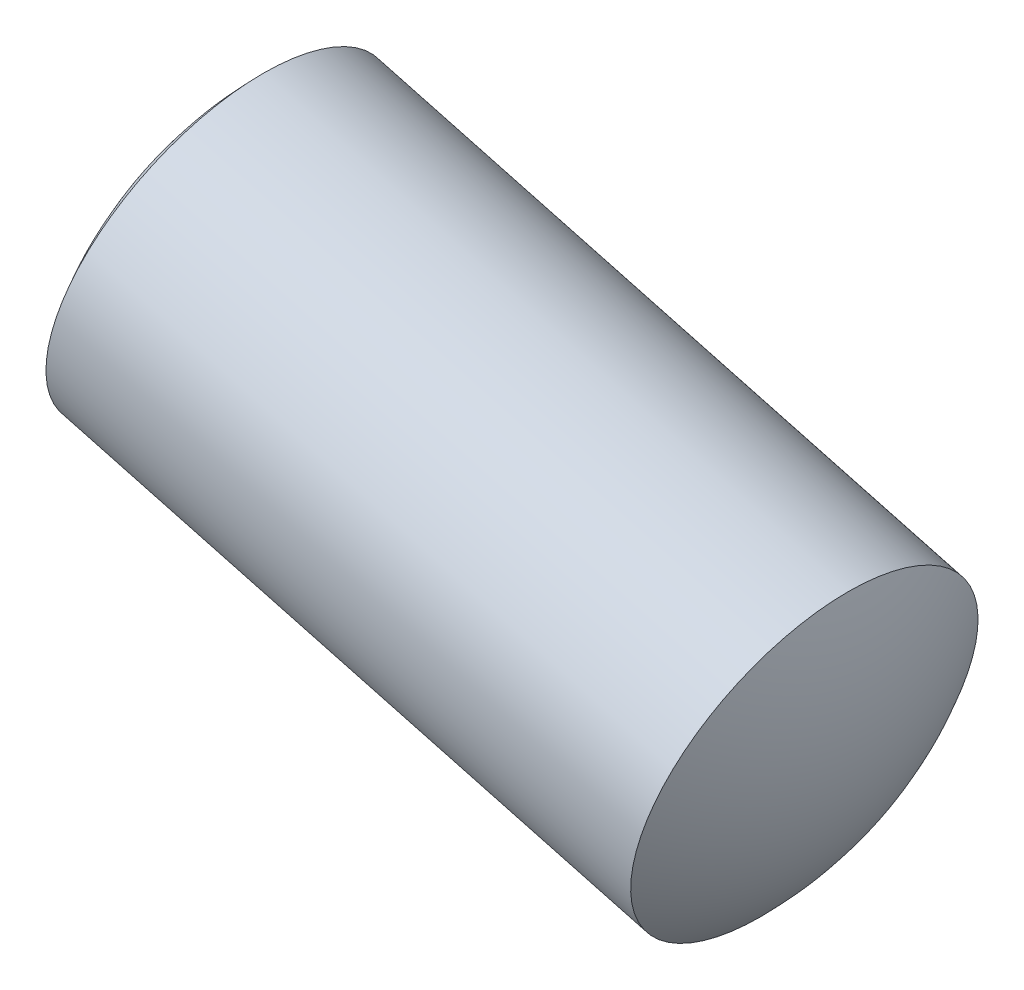
ISO-10303-21;
HEADER;
FILE_DESCRIPTION(('STEP AP214'),'2;1');
FILE_NAME('part.step','',(''),(''),'','','');
FILE_SCHEMA(('AUTOMOTIVE_DESIGN { 1 0 10303 214 1 1 1 1 }'));
ENDSEC;
DATA;
#1=APPLICATION_CONTEXT('core data for automotive mechanical design processes');
#2=APPLICATION_PROTOCOL_DEFINITION('international standard','automotive_design',2000,#1);
#3=PRODUCT_CONTEXT('',#1,'mechanical');
#4=PRODUCT('Part','Part','',(#3));
#5=PRODUCT_RELATED_PRODUCT_CATEGORY('part','',(#4));
#6=PRODUCT_DEFINITION_FORMATION('','',#4);
#7=PRODUCT_DEFINITION_CONTEXT('part definition',#1,'design');
#8=PRODUCT_DEFINITION('design','',#6,#7);
#9=PRODUCT_DEFINITION_SHAPE('','',#8);
#10=(LENGTH_UNIT() NAMED_UNIT(*) SI_UNIT(.MILLI.,.METRE.));
#11=(NAMED_UNIT(*) PLANE_ANGLE_UNIT() SI_UNIT($,.RADIAN.));
#12=(NAMED_UNIT(*) SI_UNIT($,.STERADIAN.) SOLID_ANGLE_UNIT());
#13=UNCERTAINTY_MEASURE_WITH_UNIT(LENGTH_MEASURE(1.E-05),#10,'distance_accuracy_value','');
#14=(GEOMETRIC_REPRESENTATION_CONTEXT(3) GLOBAL_UNCERTAINTY_ASSIGNED_CONTEXT((#13)) GLOBAL_UNIT_ASSIGNED_CONTEXT((#10,
#11,#12)) REPRESENTATION_CONTEXT('',''));
#15=CARTESIAN_POINT('',(0.,0.,0.));
#16=DIRECTION('',(0.,0.,1.));
#17=DIRECTION('',(1.,0.,0.));
#18=AXIS2_PLACEMENT_3D('',#15,#16,#17);
#19=CARTESIAN_POINT('',(26.6614110427164,-7.14390355797012,0.9));
#20=DIRECTION('',(-0.258819045102521,-0.965925826289068,0.));
#21=DIRECTION('',(0.965925826289068,-0.258819045102521,0.));
#22=AXIS2_PLACEMENT_3D('',#19,#20,#21);
#23=SPHERICAL_SURFACE('',#22,3.);
#24=CARTESIAN_POINT('',(26.6614110427164,-7.14390355797012,0.9));
#25=DIRECTION('',(-0.965925826289068,0.258819045102521,0.));
#26=DIRECTION('',(0.,0.,-1.));
#27=AXIS2_PLACEMENT_3D('',#24,#25,#26);
#28=SPHERICAL_SURFACE('',#27,3.);
#29=CARTESIAN_POINT('',(29.1709599539299,-7.81633516209612,0.9));
#30=DIRECTION('',(-0.965925826289068,0.258819045102521,0.));
#31=DIRECTION('',(0.,0.,-1.));
#32=AXIS2_PLACEMENT_3D('',#29,#30,#31);
#33=CIRCLE('',#32,1.5);
#34=CARTESIAN_POINT('',(29.1709599539299,-7.81633516209612,-0.6));
#35=VERTEX_POINT('',#34);
#36=EDGE_CURVE('E11',#35,#35,#33,.T.);
#37=ORIENTED_EDGE('',*,*,#36,.F.);
#38=EDGE_LOOP('',(#37));
#39=FACE_BOUND('',#38,.T.);
#40=ADVANCED_FACE('F17',(#39),#28,.T.);
#41=CARTESIAN_POINT('',(26.4645094031823,-7.09114392266852,0.9));
#42=DIRECTION('',(-0.258819045102521,-0.965925826289068,0.));
#43=DIRECTION('',(-0.965925826289068,0.258819045102521,0.));
#44=AXIS2_PLACEMENT_3D('',#41,#42,#43);
#45=SPHERICAL_SURFACE('',#44,3.);
#46=CARTESIAN_POINT('',(26.4645094031823,-7.09114392266852,0.9));
#47=DIRECTION('',(-0.965925826289068,0.258819045102521,0.));
#48=DIRECTION('',(0.,0.,-1.));
#49=AXIS2_PLACEMENT_3D('',#46,#47,#48);
#50=SPHERICAL_SURFACE('',#49,3.);
#51=CARTESIAN_POINT('',(23.9549604919689,-6.41871231854252,0.9));
#52=DIRECTION('',(-0.965925826289068,0.258819045102521,0.));
#53=DIRECTION('',(0.,0.,-1.));
#54=AXIS2_PLACEMENT_3D('',#51,#52,#53);
#55=CIRCLE('',#54,1.5);
#56=CARTESIAN_POINT('',(23.9549604919689,-6.41871231854252,-0.6));
#57=VERTEX_POINT('',#56);
#58=EDGE_CURVE('E21',#57,#57,#55,.T.);
#59=ORIENTED_EDGE('',*,*,#58,.T.);
#60=EDGE_LOOP('',(#59));
#61=FACE_BOUND('',#60,.T.);
#62=ADVANCED_FACE('F19',(#61),#50,.T.);
#63=CARTESIAN_POINT('',(25.2589603574591,-6.76811802943089,0.9));
#64=DIRECTION('',(-0.965925826289068,0.258819045102521,0.));
#65=DIRECTION('',(0.,0.,-1.));
#66=AXIS2_PLACEMENT_3D('',#63,#64,#65);
#67=CYLINDRICAL_SURFACE('',#66,1.5);
#68=ORIENTED_EDGE('',*,*,#36,.T.);
#69=EDGE_LOOP('',(#68));
#70=FACE_BOUND('',#69,.T.);
#71=ORIENTED_EDGE('',*,*,#58,.F.);
#72=EDGE_LOOP('',(#71));
#73=FACE_BOUND('',#72,.T.);
#74=ADVANCED_FACE('F57',(#70,#73),#67,.T.);
#75=CLOSED_SHELL('',(#40,#62,#74));
#76=MANIFOLD_SOLID_BREP('B1',#75);
#77=ADVANCED_BREP_SHAPE_REPRESENTATION('',(#18,#76),#14);
#78=SHAPE_DEFINITION_REPRESENTATION(#9,#77);
ENDSEC;
END-ISO-10303-21;
